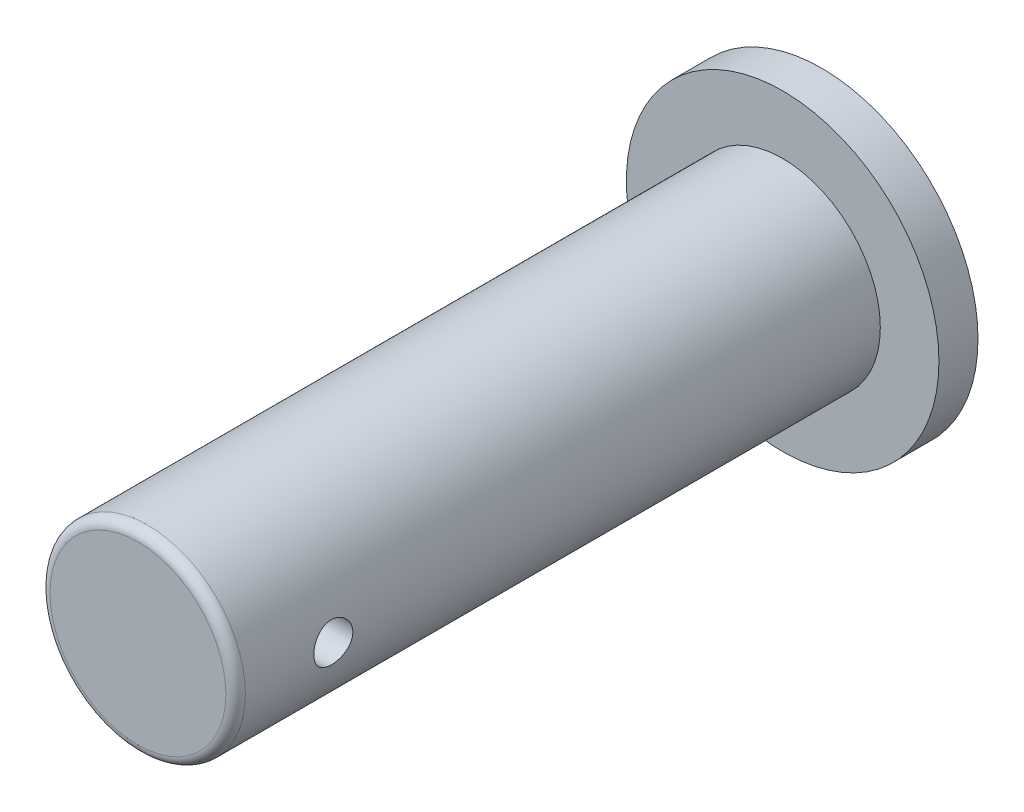
ISO-10303-21;
HEADER;
FILE_DESCRIPTION(('STEP AP214'),'2;1');
FILE_NAME('part.step','',(''),(''),'','','');
FILE_SCHEMA(('AUTOMOTIVE_DESIGN { 1 0 10303 214 1 1 1 1 }'));
ENDSEC;
DATA;
#1=APPLICATION_CONTEXT('core data for automotive mechanical design processes');
#2=APPLICATION_PROTOCOL_DEFINITION('international standard','automotive_design',2000,#1);
#3=PRODUCT_CONTEXT('',#1,'mechanical');
#4=PRODUCT('Part','Part','',(#3));
#5=PRODUCT_RELATED_PRODUCT_CATEGORY('part','',(#4));
#6=PRODUCT_DEFINITION_FORMATION('','',#4);
#7=PRODUCT_DEFINITION_CONTEXT('part definition',#1,'design');
#8=PRODUCT_DEFINITION('design','',#6,#7);
#9=PRODUCT_DEFINITION_SHAPE('','',#8);
#10=(LENGTH_UNIT() NAMED_UNIT(*) SI_UNIT(.MILLI.,.METRE.));
#11=(NAMED_UNIT(*) PLANE_ANGLE_UNIT() SI_UNIT($,.RADIAN.));
#12=(NAMED_UNIT(*) SI_UNIT($,.STERADIAN.) SOLID_ANGLE_UNIT());
#13=UNCERTAINTY_MEASURE_WITH_UNIT(LENGTH_MEASURE(1.E-05),#10,'distance_accuracy_value','');
#14=(GEOMETRIC_REPRESENTATION_CONTEXT(3) GLOBAL_UNCERTAINTY_ASSIGNED_CONTEXT((#13)) GLOBAL_UNIT_ASSIGNED_CONTEXT((#10,
#11,#12)) REPRESENTATION_CONTEXT('',''));
#15=CARTESIAN_POINT('',(0.,0.,0.));
#16=DIRECTION('',(0.,0.,1.));
#17=DIRECTION('',(1.,0.,0.));
#18=AXIS2_PLACEMENT_3D('',#15,#16,#17);
#19=CARTESIAN_POINT('',(0.,0.,35.));
#20=DIRECTION('',(0.,0.,-1.));
#21=DIRECTION('',(-1.,0.,0.));
#22=AXIS2_PLACEMENT_3D('',#19,#20,#21);
#23=CYLINDRICAL_SURFACE('',#22,5.);
#24=CARTESIAN_POINT('',(0.,0.,34.5));
#25=DIRECTION('',(0.,0.,1.));
#26=DIRECTION('',(1.,0.,0.));
#27=AXIS2_PLACEMENT_3D('',#24,#25,#26);
#28=CIRCLE('',#27,5.);
#29=CARTESIAN_POINT('',(5.,0.,34.5));
#30=VERTEX_POINT('',#29);
#31=EDGE_CURVE('E10',#30,#30,#28,.F.);
#32=ORIENTED_EDGE('',*,*,#31,.T.);
#33=EDGE_LOOP('',(#32));
#34=FACE_BOUND('',#33,.T.);
#35=CARTESIAN_POINT('',(-5.,0.,31.));
#36=CARTESIAN_POINT('',(-4.99999897580871,-0.055576906792633,30.9999979555017));
#37=CARTESIAN_POINT('',(-4.99906385178231,-0.111179660201522,30.9953511570324));
#38=CARTESIAN_POINT('',(-4.99542365623231,-0.220813507689019,30.9769014998848));
#39=CARTESIAN_POINT('',(-4.99271717860186,-0.274843317541356,30.9630913671985));
#40=CARTESIAN_POINT('',(-4.98583649278287,-0.379730305263313,30.9267587263792));
#41=CARTESIAN_POINT('',(-4.98166369076718,-0.430590467933134,30.9042445631553));
#42=CARTESIAN_POINT('',(-4.97230398035314,-0.527807988864226,30.8511677524887));
#43=CARTESIAN_POINT('',(-4.96711713235707,-0.574165615075813,30.8206055843928));
#44=CARTESIAN_POINT('',(-4.9562216532997,-0.661693477314866,30.7518615057086));
#45=CARTESIAN_POINT('',(-4.95050745504347,-0.702793951158526,30.7135916446088));
#46=CARTESIAN_POINT('',(-4.93924180452588,-0.778036756608029,30.6307075836083));
#47=CARTESIAN_POINT('',(-4.93369036500424,-0.812178544770426,30.5860928886649));
#48=CARTESIAN_POINT('',(-4.92332441812615,-0.872831753347622,30.4912838069881));
#49=CARTESIAN_POINT('',(-4.91851707364946,-0.899270938865868,30.4410423562036));
#50=CARTESIAN_POINT('',(-4.91026268058418,-0.943305666580309,30.3367181809959));
#51=CARTESIAN_POINT('',(-4.90681549761962,-0.960902082437239,30.2826358366537));
#52=CARTESIAN_POINT('',(-4.90172805252205,-0.986525299884829,30.1729156360921));
#53=CARTESIAN_POINT('',(-4.90006470107188,-0.994674497958778,30.1173074558578));
#54=CARTESIAN_POINT('',(-4.89866375060627,-1.00155212772612,30.0054901786357));
#55=CARTESIAN_POINT('',(-4.89892595467841,-1.0002815227135,29.9492811436799));
#56=CARTESIAN_POINT('',(-4.90132551148185,-0.98845457310182,29.838753211979));
#57=CARTESIAN_POINT('',(-4.90343452858764,-0.978038540243907,29.7844185943727));
#58=CARTESIAN_POINT('',(-4.90924546160001,-0.948437884623052,29.678283923337));
#59=CARTESIAN_POINT('',(-4.91294745357779,-0.929252843100682,29.626483991081));
#60=CARTESIAN_POINT('',(-4.92155618500408,-0.88252478367472,29.5264847382964));
#61=CARTESIAN_POINT('',(-4.92647089813704,-0.854926151232115,29.4783121204308));
#62=CARTESIAN_POINT('',(-4.93694618773062,-0.79219357457268,29.3872291500272));
#63=CARTESIAN_POINT('',(-4.94250683838366,-0.75705876435683,29.3443194031488));
#64=CARTESIAN_POINT('',(-4.95377021241462,-0.679499934560586,29.2641705975431));
#65=CARTESIAN_POINT('',(-4.95947369210905,-0.636956161212446,29.2270474321409));
#66=CARTESIAN_POINT('',(-4.97028848714409,-0.54618502406201,29.1604461536988));
#67=CARTESIAN_POINT('',(-4.97539979488974,-0.497957587379389,29.1309681387064));
#68=CARTESIAN_POINT('',(-4.98446690160887,-0.39705938687892,29.080472490774));
#69=CARTESIAN_POINT('',(-4.98842088848272,-0.344381819585299,29.0594681063555));
#70=CARTESIAN_POINT('',(-4.99471408987858,-0.236148976448664,29.0266395259614));
#71=CARTESIAN_POINT('',(-4.99705350000531,-0.180594050072449,29.0148142179264));
#72=CARTESIAN_POINT('',(-4.99982671866868,-0.0691794056271505,29.0008435462057));
#73=CARTESIAN_POINT('',(-5.0002917465247,-0.0133403283255763,28.9985395804597));
#74=CARTESIAN_POINT('',(-4.99935051930103,0.0979249341927141,29.0032498589422));
#75=CARTESIAN_POINT('',(-4.99794436941446,0.153351142443793,29.0102635793526));
#76=CARTESIAN_POINT('',(-4.99343832008018,0.261705659946541,29.033278373544));
#77=CARTESIAN_POINT('',(-4.99035376404206,0.314651948339904,29.0491980684979));
#78=CARTESIAN_POINT('',(-4.98283552061033,0.417123627499668,29.0894839826558));
#79=CARTESIAN_POINT('',(-4.97840173214227,0.46664876163754,29.1138508346768));
#80=CARTESIAN_POINT('',(-4.96859911533294,0.561541173686218,29.1706824906513));
#81=CARTESIAN_POINT('',(-4.96321950437052,0.606850126752188,29.2032427810389));
#82=CARTESIAN_POINT('',(-4.95214734829882,0.691418019119207,29.2754091912073));
#83=CARTESIAN_POINT('',(-4.94645476968388,0.730676308930763,29.3150160663999));
#84=CARTESIAN_POINT('',(-4.93529303556965,0.802640590774178,29.4008733518911));
#85=CARTESIAN_POINT('',(-4.92982860233304,0.835237702448658,29.4472157442213));
#86=CARTESIAN_POINT('',(-4.91984191796194,0.892185420051209,29.5448113613567));
#87=CARTESIAN_POINT('',(-4.91531962913343,0.916536355922905,29.5960643895736));
#88=CARTESIAN_POINT('',(-4.90776740584383,0.956151841581962,29.7017682461496));
#89=CARTESIAN_POINT('',(-4.90472974872187,0.971463499791053,29.7562008412103));
#90=CARTESIAN_POINT('',(-4.90047436792025,0.992708651627198,29.8669334534909));
#91=CARTESIAN_POINT('',(-4.89925640691111,0.998643368225114,29.9232332262094));
#92=CARTESIAN_POINT('',(-4.89879149631379,1.00092091086747,30.0350088645443));
#93=CARTESIAN_POINT('',(-4.89950919189301,0.997435788070897,30.090481148927));
#94=CARTESIAN_POINT('',(-4.90275573484614,0.981352304100061,30.200031649905));
#95=CARTESIAN_POINT('',(-4.90528456767169,0.968754016129299,30.2541098776948));
#96=CARTESIAN_POINT('',(-4.91185264219159,0.934878568498955,30.3592277112406));
#97=CARTESIAN_POINT('',(-4.91588821018831,0.913622506717345,30.4102743605024));
#98=CARTESIAN_POINT('',(-4.9250171497417,0.863054644601605,30.5081037207344));
#99=CARTESIAN_POINT('',(-4.93011060998894,0.833742168774884,30.5548860737251));
#100=CARTESIAN_POINT('',(-4.94088960523225,0.767305914786417,30.6437155721503));
#101=CARTESIAN_POINT('',(-4.946583729097,0.730057887235182,30.6856687652676));
#102=CARTESIAN_POINT('',(-4.95786081871955,0.649064369013141,30.7627862055292));
#103=CARTESIAN_POINT('',(-4.96344375863184,0.605317387153335,30.7979488903173));
#104=CARTESIAN_POINT('',(-4.97393832387971,0.512017629088247,30.8608346439465));
#105=CARTESIAN_POINT('',(-4.97884231219246,0.462408884429834,30.88847600328));
#106=CARTESIAN_POINT('',(-4.98735125085,0.359166360940732,30.9349861225966));
#107=CARTESIAN_POINT('',(-4.99095737138616,0.305536260863127,30.9538627895325));
#108=CARTESIAN_POINT('',(-4.99576372595371,0.20982148892378,30.9786519480447));
#109=CARTESIAN_POINT('',(-4.99734303158452,0.168281664013785,30.9866431937078));
#110=CARTESIAN_POINT('',(-4.99946154139893,0.0844995252100672,30.9973179123584));
#111=CARTESIAN_POINT('',(-5.00000077873155,0.0422572337486192,31.0000015545098));
#112=CARTESIAN_POINT('',(-5.,0.,31.));
#113=B_SPLINE_CURVE_WITH_KNOTS('',3,(#35,#36,#37,#38,#39,#40,#41,#42,#43,#44,#45,#46,#47,#48,
#49,#50,#51,#52,#53,#54,#55,#56,#57,#58,#59,#60,#61,#62,#63,#64,#65,#66,#67,#68,#69,#70,#71,#72,
#73,#74,#75,#76,#77,#78,#79,#80,#81,#82,#83,#84,#85,#86,#87,#88,#89,#90,#91,#92,#93,#94,#95,#96,
#97,#98,#99,#100,#101,#102,#103,#104,#105,#106,#107,#108,#109,#110,#111,#112),.UNSPECIFIED.,.T.,
.F.,(4,2,2,2,2,2,2,2,2,2,2,2,2,2,2,2,2,2,2,2,2,2,2,2,2,2,2,2,2,2,2,2,2,2,2,2,2,2,4),(0.,
0.166576130661258,0.333284650691324,0.499833735250342,0.666372902230864,0.834932670112187,
1.00350559674737,1.17361195005923,1.34370149365198,1.51156185103587,1.67940504281225,
1.84471727006278,2.0100373925373,2.17647490203593,2.3429315474967,2.51238252491351,
2.68183567539821,2.85155274854024,3.02124925698036,3.18810735676266,3.35495607657868,
3.52030453950724,3.68566539216023,3.85305066033359,4.02045388345931,4.19040628579227,
4.36035188723468,4.52940381032725,4.69843368330416,4.86439722567703,5.0303594349261,
5.19591961253111,5.36149367581867,5.52988076239144,5.69830654532932,5.86849496675638,
6.0385295551752,6.16518775289895,6.29184191370997),.UNSPECIFIED.);
#114=CARTESIAN_POINT('',(-5.,0.,31.));
#115=VERTEX_POINT('',#114);
#116=EDGE_CURVE('E48',#115,#115,#113,.T.);
#117=ORIENTED_EDGE('',*,*,#116,.T.);
#118=EDGE_LOOP('',(#117));
#119=FACE_BOUND('',#118,.T.);
#120=CARTESIAN_POINT('',(5.,0.,29.));
#121=CARTESIAN_POINT('',(4.99999897580871,-0.0555769067926332,29.0000020444983));
#122=CARTESIAN_POINT('',(4.99906385178231,-0.111179660201523,29.0046488429676));
#123=CARTESIAN_POINT('',(4.99542365623231,-0.22081350768902,29.0230985001152));
#124=CARTESIAN_POINT('',(4.99271717860186,-0.274843317541356,29.0369086328015));
#125=CARTESIAN_POINT('',(4.98583649278287,-0.379730305263314,29.0732412736208));
#126=CARTESIAN_POINT('',(4.98166369076718,-0.430590467933135,29.0957554368447));
#127=CARTESIAN_POINT('',(4.97230398035314,-0.527807988864227,29.1488322475113));
#128=CARTESIAN_POINT('',(4.96711713235707,-0.574165615075814,29.1793944156072));
#129=CARTESIAN_POINT('',(4.9562216532997,-0.661693477314866,29.2481384942914));
#130=CARTESIAN_POINT('',(4.95050745504347,-0.702793951158526,29.2864083553912));
#131=CARTESIAN_POINT('',(4.93924180452588,-0.778036756608029,29.3692924163917));
#132=CARTESIAN_POINT('',(4.93369036500424,-0.812178544770426,29.4139071113351));
#133=CARTESIAN_POINT('',(4.92332441812615,-0.872831753347622,29.5087161930119));
#134=CARTESIAN_POINT('',(4.91851707364946,-0.899270938865868,29.5589576437964));
#135=CARTESIAN_POINT('',(4.91026268058418,-0.943305666580309,29.6632818190041));
#136=CARTESIAN_POINT('',(4.90681549761962,-0.960902082437239,29.7173641633463));
#137=CARTESIAN_POINT('',(4.90172805252205,-0.986525299884829,29.8270843639079));
#138=CARTESIAN_POINT('',(4.90006470107188,-0.994674497958778,29.8826925441422));
#139=CARTESIAN_POINT('',(4.89866375060627,-1.00155212772612,29.9945098213643));
#140=CARTESIAN_POINT('',(4.89892595467841,-1.0002815227135,30.0507188563201));
#141=CARTESIAN_POINT('',(4.90132551148185,-0.98845457310182,30.161246788021));
#142=CARTESIAN_POINT('',(4.90343452858764,-0.978038540243907,30.2155814056273));
#143=CARTESIAN_POINT('',(4.90924546160001,-0.948437884623051,30.321716076663));
#144=CARTESIAN_POINT('',(4.91294745357779,-0.929252843100682,30.373516008919));
#145=CARTESIAN_POINT('',(4.92155618500408,-0.88252478367472,30.4735152617036));
#146=CARTESIAN_POINT('',(4.92647089813704,-0.854926151232115,30.5216878795692));
#147=CARTESIAN_POINT('',(4.93694618773062,-0.79219357457268,30.6127708499728));
#148=CARTESIAN_POINT('',(4.94250683838366,-0.75705876435683,30.6556805968512));
#149=CARTESIAN_POINT('',(4.95377021241462,-0.679499934560586,30.7358294024569));
#150=CARTESIAN_POINT('',(4.95947369210905,-0.636956161212446,30.7729525678591));
#151=CARTESIAN_POINT('',(4.97028848714409,-0.54618502406201,30.8395538463012));
#152=CARTESIAN_POINT('',(4.97539979488974,-0.497957587379389,30.8690318612936));
#153=CARTESIAN_POINT('',(4.98446690160887,-0.39705938687892,30.919527509226));
#154=CARTESIAN_POINT('',(4.98842088848272,-0.3443818195853,30.9405318936445));
#155=CARTESIAN_POINT('',(4.99471408987858,-0.236148976448665,30.9733604740386));
#156=CARTESIAN_POINT('',(4.99705350000531,-0.18059405007245,30.9851857820736));
#157=CARTESIAN_POINT('',(4.99982671866868,-0.0691794056271505,30.9991564537943));
#158=CARTESIAN_POINT('',(5.0002917465247,-0.0133403283255763,31.0014604195403));
#159=CARTESIAN_POINT('',(4.99935051930103,0.0979249341927141,30.9967501410578));
#160=CARTESIAN_POINT('',(4.99794436941446,0.153351142443793,30.9897364206474));
#161=CARTESIAN_POINT('',(4.99343832008018,0.261705659946541,30.966721626456));
#162=CARTESIAN_POINT('',(4.99035376404206,0.314651948339903,30.9508019315021));
#163=CARTESIAN_POINT('',(4.98283552061033,0.417123627499667,30.9105160173442));
#164=CARTESIAN_POINT('',(4.97840173214227,0.46664876163754,30.8861491653232));
#165=CARTESIAN_POINT('',(4.96859911533294,0.561541173686218,30.8293175093487));
#166=CARTESIAN_POINT('',(4.96321950437052,0.606850126752188,30.7967572189611));
#167=CARTESIAN_POINT('',(4.95214734829882,0.691418019119207,30.7245908087927));
#168=CARTESIAN_POINT('',(4.94645476968388,0.730676308930763,30.6849839336001));
#169=CARTESIAN_POINT('',(4.93529303556965,0.802640590774177,30.5991266481089));
#170=CARTESIAN_POINT('',(4.92982860233304,0.835237702448656,30.5527842557787));
#171=CARTESIAN_POINT('',(4.91984191796194,0.892185420051207,30.4551886386433));
#172=CARTESIAN_POINT('',(4.91531962913343,0.916536355922904,30.4039356104264));
#173=CARTESIAN_POINT('',(4.90776740584383,0.956151841581962,30.2982317538504));
#174=CARTESIAN_POINT('',(4.90472974872187,0.971463499791053,30.2437991587897));
#175=CARTESIAN_POINT('',(4.90047436792025,0.992708651627198,30.1330665465091));
#176=CARTESIAN_POINT('',(4.89925640691111,0.998643368225114,30.0767667737907));
#177=CARTESIAN_POINT('',(4.89879149631379,1.00092091086747,29.9649911354557));
#178=CARTESIAN_POINT('',(4.89950919189301,0.997435788070897,29.909518851073));
#179=CARTESIAN_POINT('',(4.90275573484614,0.981352304100062,29.799968350095));
#180=CARTESIAN_POINT('',(4.90528456767169,0.9687540161293,29.7458901223052));
#181=CARTESIAN_POINT('',(4.91185264219159,0.934878568498955,29.6407722887595));
#182=CARTESIAN_POINT('',(4.91588821018831,0.913622506717345,29.5897256394976));
#183=CARTESIAN_POINT('',(4.9250171497417,0.863054644601605,29.4918962792656));
#184=CARTESIAN_POINT('',(4.93011060998894,0.833742168774884,29.4451139262749));
#185=CARTESIAN_POINT('',(4.94088960523225,0.767305914786417,29.3562844278497));
#186=CARTESIAN_POINT('',(4.946583729097,0.730057887235182,29.3143312347324));
#187=CARTESIAN_POINT('',(4.95786081871955,0.649064369013141,29.2372137944708));
#188=CARTESIAN_POINT('',(4.96344375863184,0.605317387153335,29.2020511096827));
#189=CARTESIAN_POINT('',(4.97393832387971,0.512017629088247,29.1391653560536));
#190=CARTESIAN_POINT('',(4.97884231219246,0.462408884429834,29.11152399672));
#191=CARTESIAN_POINT('',(4.98735125085,0.359166360940732,29.0650138774034));
#192=CARTESIAN_POINT('',(4.99095737138616,0.305536260863127,29.0461372104675));
#193=CARTESIAN_POINT('',(4.99576372595371,0.20982148892378,29.0213480519553));
#194=CARTESIAN_POINT('',(4.99734303158452,0.168281664013785,29.0133568062922));
#195=CARTESIAN_POINT('',(4.99946154139893,0.0844995252100671,29.0026820876416));
#196=CARTESIAN_POINT('',(5.00000077873155,0.0422572337486191,28.9999984454902));
#197=CARTESIAN_POINT('',(5.,0.,29.));
#198=B_SPLINE_CURVE_WITH_KNOTS('',3,(#120,#121,#122,#123,#124,#125,#126,#127,#128,#129,#130,
#131,#132,#133,#134,#135,#136,#137,#138,#139,#140,#141,#142,#143,#144,#145,#146,#147,#148,#149,
#150,#151,#152,#153,#154,#155,#156,#157,#158,#159,#160,#161,#162,#163,#164,#165,#166,#167,#168,
#169,#170,#171,#172,#173,#174,#175,#176,#177,#178,#179,#180,#181,#182,#183,#184,#185,#186,#187,
#188,#189,#190,#191,#192,#193,#194,#195,#196,#197),.UNSPECIFIED.,.T.,.F.,(4,2,2,2,2,2,2,2,2,2,2,
2,2,2,2,2,2,2,2,2,2,2,2,2,2,2,2,2,2,2,2,2,2,2,2,2,2,2,4),(0.,0.166576130661258,
0.333284650691324,0.499833735250344,0.666372902230864,0.834932670112187,1.00350559674737,
1.17361195005923,1.34370149365198,1.51156185103587,1.67940504281225,1.84471727006279,
2.0100373925373,2.17647490203593,2.3429315474967,2.51238252491351,2.68183567539821,
2.85155274854024,3.02124925698036,3.18810735676266,3.35495607657868,3.52030453950724,
3.68566539216023,3.85305066033359,4.02045388345931,4.19040628579226,4.36035188723467,
4.52940381032724,4.69843368330416,4.86439722567702,5.03035943492609,5.19591961253111,
5.36149367581867,5.52988076239144,5.69830654532931,5.86849496675638,6.03852955517519,
6.16518775289895,6.29184191370997),.UNSPECIFIED.);
#199=CARTESIAN_POINT('',(5.,0.,29.));
#200=VERTEX_POINT('',#199);
#201=EDGE_CURVE('E55',#200,#200,#198,.T.);
#202=ORIENTED_EDGE('',*,*,#201,.T.);
#203=EDGE_LOOP('',(#202));
#204=FACE_BOUND('',#203,.T.);
#205=CARTESIAN_POINT('',(0.,0.,2.));
#206=DIRECTION('',(0.,0.,1.));
#207=DIRECTION('',(1.,0.,0.));
#208=AXIS2_PLACEMENT_3D('',#205,#206,#207);
#209=CIRCLE('',#208,5.);
#210=CARTESIAN_POINT('',(5.,0.,2.));
#211=VERTEX_POINT('',#210);
#212=EDGE_CURVE('E54',#211,#211,#209,.T.);
#213=ORIENTED_EDGE('',*,*,#212,.T.);
#214=EDGE_LOOP('',(#213));
#215=FACE_BOUND('',#214,.T.);
#216=ADVANCED_FACE('F30',(#34,#119,#204,#215),#23,.T.);
#217=CARTESIAN_POINT('',(0.,0.,35.));
#218=DIRECTION('',(0.,0.,1.));
#219=DIRECTION('',(1.,0.,0.));
#220=AXIS2_PLACEMENT_3D('',#217,#218,#219);
#221=PLANE('',#220);
#222=CARTESIAN_POINT('',(0.,0.,35.));
#223=DIRECTION('',(0.,0.,1.));
#224=DIRECTION('',(1.,0.,0.));
#225=AXIS2_PLACEMENT_3D('',#222,#223,#224);
#226=CIRCLE('',#225,4.5);
#227=CARTESIAN_POINT('',(4.5,0.,35.));
#228=VERTEX_POINT('',#227);
#229=EDGE_CURVE('E37',#228,#228,#226,.T.);
#230=ORIENTED_EDGE('',*,*,#229,.T.);
#231=EDGE_LOOP('',(#230));
#232=FACE_BOUND('',#231,.T.);
#233=ADVANCED_FACE('F72',(#232),#221,.T.);
#234=CARTESIAN_POINT('',(0.,0.,2.));
#235=DIRECTION('',(0.,0.,1.));
#236=DIRECTION('',(1.,0.,0.));
#237=AXIS2_PLACEMENT_3D('',#234,#235,#236);
#238=PLANE('',#237);
#239=CARTESIAN_POINT('',(0.,0.,2.));
#240=DIRECTION('',(0.,0.,1.));
#241=DIRECTION('',(1.,0.,0.));
#242=AXIS2_PLACEMENT_3D('',#239,#240,#241);
#243=CIRCLE('',#242,8.);
#244=CARTESIAN_POINT('',(8.,0.,2.));
#245=VERTEX_POINT('',#244);
#246=EDGE_CURVE('E41',#245,#245,#243,.T.);
#247=ORIENTED_EDGE('',*,*,#246,.T.);
#248=EDGE_LOOP('',(#247));
#249=FACE_BOUND('',#248,.T.);
#250=ORIENTED_EDGE('',*,*,#212,.F.);
#251=EDGE_LOOP('',(#250));
#252=FACE_BOUND('',#251,.T.);
#253=ADVANCED_FACE('F67',(#249,#252),#238,.T.);
#254=CARTESIAN_POINT('',(0.,0.,2.));
#255=DIRECTION('',(0.,0.,-1.));
#256=DIRECTION('',(-1.,0.,0.));
#257=AXIS2_PLACEMENT_3D('',#254,#255,#256);
#258=CYLINDRICAL_SURFACE('',#257,8.);
#259=ORIENTED_EDGE('',*,*,#246,.F.);
#260=EDGE_LOOP('',(#259));
#261=FACE_BOUND('',#260,.T.);
#262=CARTESIAN_POINT('',(0.,0.,0.));
#263=DIRECTION('',(0.,0.,1.));
#264=DIRECTION('',(1.,0.,0.));
#265=AXIS2_PLACEMENT_3D('',#262,#263,#264);
#266=CIRCLE('',#265,8.);
#267=CARTESIAN_POINT('',(8.,0.,0.));
#268=VERTEX_POINT('',#267);
#269=EDGE_CURVE('E45',#268,#268,#266,.T.);
#270=ORIENTED_EDGE('',*,*,#269,.T.);
#271=EDGE_LOOP('',(#270));
#272=FACE_BOUND('',#271,.T.);
#273=ADVANCED_FACE('F71',(#261,#272),#258,.T.);
#274=CARTESIAN_POINT('',(0.,0.,0.));
#275=DIRECTION('',(0.,0.,1.));
#276=DIRECTION('',(1.,0.,0.));
#277=AXIS2_PLACEMENT_3D('',#274,#275,#276);
#278=PLANE('',#277);
#279=ORIENTED_EDGE('',*,*,#269,.F.);
#280=EDGE_LOOP('',(#279));
#281=FACE_BOUND('',#280,.T.);
#282=ADVANCED_FACE('F65',(#281),#278,.F.);
#283=CARTESIAN_POINT('',(-8.,0.,30.));
#284=DIRECTION('',(1.,0.,0.));
#285=DIRECTION('',(0.,0.,-1.));
#286=AXIS2_PLACEMENT_3D('',#283,#284,#285);
#287=CYLINDRICAL_SURFACE('',#286,1.);
#288=ORIENTED_EDGE('',*,*,#201,.F.);
#289=EDGE_LOOP('',(#288));
#290=FACE_BOUND('',#289,.T.);
#291=ORIENTED_EDGE('',*,*,#116,.F.);
#292=EDGE_LOOP('',(#291));
#293=FACE_BOUND('',#292,.T.);
#294=ADVANCED_FACE('F61',(#290,#293),#287,.F.);
#295=CARTESIAN_POINT('',(0.,0.,34.5));
#296=DIRECTION('',(0.,0.,1.));
#297=DIRECTION('',(1.,0.,0.));
#298=AXIS2_PLACEMENT_3D('',#295,#296,#297);
#299=TOROIDAL_SURFACE('',#298,4.5,0.5);
#300=ORIENTED_EDGE('',*,*,#31,.F.);
#301=EDGE_LOOP('',(#300));
#302=FACE_BOUND('',#301,.T.);
#303=ORIENTED_EDGE('',*,*,#229,.F.);
#304=EDGE_LOOP('',(#303));
#305=FACE_BOUND('',#304,.T.);
#306=ADVANCED_FACE('F32',(#302,#305),#299,.T.);
#307=CLOSED_SHELL('',(#216,#233,#253,#273,#282,#294,#306));
#308=MANIFOLD_SOLID_BREP('B2',#307);
#309=ADVANCED_BREP_SHAPE_REPRESENTATION('',(#18,#308),#14);
#310=SHAPE_DEFINITION_REPRESENTATION(#9,#309);
ENDSEC;
END-ISO-10303-21;
